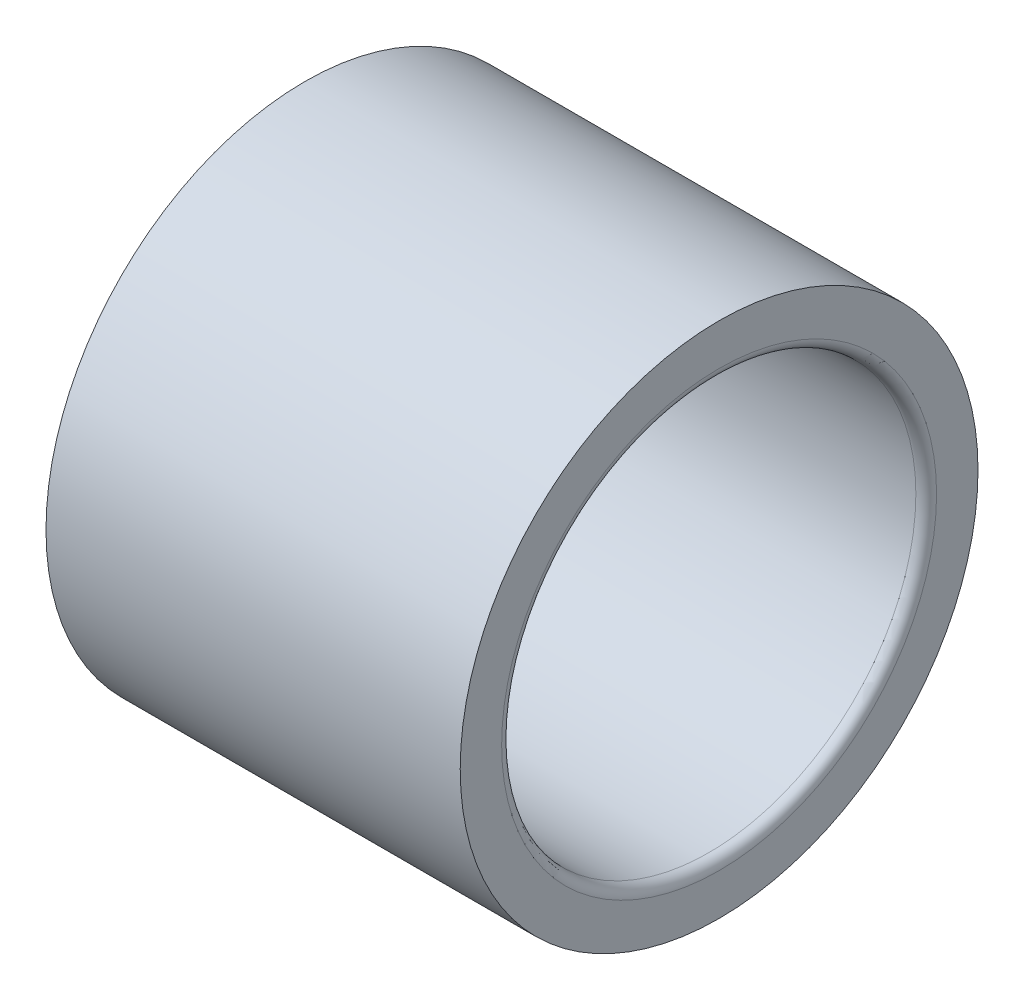
ISO-10303-21;
HEADER;
FILE_DESCRIPTION(('STEP AP214'),'2;1');
FILE_NAME('part.step','',(''),(''),'','','');
FILE_SCHEMA(('AUTOMOTIVE_DESIGN { 1 0 10303 214 1 1 1 1 }'));
ENDSEC;
DATA;
#1=APPLICATION_CONTEXT('core data for automotive mechanical design processes');
#2=APPLICATION_PROTOCOL_DEFINITION('international standard','automotive_design',2000,#1);
#3=PRODUCT_CONTEXT('',#1,'mechanical');
#4=PRODUCT('Part','Part','',(#3));
#5=PRODUCT_RELATED_PRODUCT_CATEGORY('part','',(#4));
#6=PRODUCT_DEFINITION_FORMATION('','',#4);
#7=PRODUCT_DEFINITION_CONTEXT('part definition',#1,'design');
#8=PRODUCT_DEFINITION('design','',#6,#7);
#9=PRODUCT_DEFINITION_SHAPE('','',#8);
#10=(LENGTH_UNIT() NAMED_UNIT(*) SI_UNIT(.MILLI.,.METRE.));
#11=(NAMED_UNIT(*) PLANE_ANGLE_UNIT() SI_UNIT($,.RADIAN.));
#12=(NAMED_UNIT(*) SI_UNIT($,.STERADIAN.) SOLID_ANGLE_UNIT());
#13=UNCERTAINTY_MEASURE_WITH_UNIT(LENGTH_MEASURE(1.E-05),#10,'distance_accuracy_value','');
#14=(GEOMETRIC_REPRESENTATION_CONTEXT(3) GLOBAL_UNCERTAINTY_ASSIGNED_CONTEXT((#13)) GLOBAL_UNIT_ASSIGNED_CONTEXT((#10,
#11,#12)) REPRESENTATION_CONTEXT('',''));
#15=CARTESIAN_POINT('',(0.,0.,0.));
#16=DIRECTION('',(0.,0.,1.));
#17=DIRECTION('',(1.,0.,0.));
#18=AXIS2_PLACEMENT_3D('',#15,#16,#17);
#19=CARTESIAN_POINT('',(239.,0.,0.));
#20=DIRECTION('',(1.,0.,0.));
#21=DIRECTION('',(0.,0.,-1.));
#22=AXIS2_PLACEMENT_3D('',#19,#20,#21);
#23=CYLINDRICAL_SURFACE('',#22,4.);
#24=CARTESIAN_POINT('',(235.2,0.,0.));
#25=DIRECTION('',(-1.,0.,0.));
#26=DIRECTION('',(0.,0.,1.));
#27=AXIS2_PLACEMENT_3D('',#24,#25,#26);
#28=CIRCLE('',#27,4.);
#29=CARTESIAN_POINT('',(235.2,0.,4.));
#30=VERTEX_POINT('',#29);
#31=EDGE_CURVE('E59',#30,#30,#28,.F.);
#32=ORIENTED_EDGE('',*,*,#31,.F.);
#33=EDGE_LOOP('',(#32));
#34=FACE_BOUND('',#33,.T.);
#35=CARTESIAN_POINT('',(242.8,0.,0.));
#36=DIRECTION('',(-1.,0.,0.));
#37=DIRECTION('',(0.,0.,1.));
#38=AXIS2_PLACEMENT_3D('',#35,#36,#37);
#39=CIRCLE('',#38,4.);
#40=CARTESIAN_POINT('',(242.8,0.,4.));
#41=VERTEX_POINT('',#40);
#42=EDGE_CURVE('E253',#41,#41,#39,.T.);
#43=ORIENTED_EDGE('',*,*,#42,.F.);
#44=EDGE_LOOP('',(#43));
#45=FACE_BOUND('',#44,.T.);
#46=ADVANCED_FACE('F16',(#34,#45),#23,.F.);
#47=CARTESIAN_POINT('',(242.8,0.,0.));
#48=DIRECTION('',(-1.,0.,0.));
#49=DIRECTION('',(0.,0.,1.));
#50=AXIS2_PLACEMENT_3D('',#47,#48,#49);
#51=TOROIDAL_SURFACE('',#50,4.2,0.200000000000001);
#52=ORIENTED_EDGE('',*,*,#42,.T.);
#53=EDGE_LOOP('',(#52));
#54=FACE_BOUND('',#53,.T.);
#55=CARTESIAN_POINT('',(243.,0.,0.));
#56=DIRECTION('',(1.,0.,0.));
#57=DIRECTION('',(0.,0.,-1.));
#58=AXIS2_PLACEMENT_3D('',#55,#56,#57);
#59=CIRCLE('',#58,4.2);
#60=CARTESIAN_POINT('',(243.,4.2,0.));
#61=VERTEX_POINT('',#60);
#62=CARTESIAN_POINT('',(243.,0.,-4.2));
#63=VERTEX_POINT('',#62);
#64=EDGE_CURVE('E51',#61,#63,#59,.F.);
#65=ORIENTED_EDGE('',*,*,#64,.F.);
#66=CARTESIAN_POINT('',(243.,0.,0.));
#67=DIRECTION('',(1.,0.,0.));
#68=DIRECTION('',(0.,1.,0.));
#69=AXIS2_PLACEMENT_3D('',#66,#67,#68);
#70=CIRCLE('',#69,4.2);
#71=CARTESIAN_POINT('',(243.,0.,4.2));
#72=VERTEX_POINT('',#71);
#73=EDGE_CURVE('E55',#72,#61,#70,.F.);
#74=ORIENTED_EDGE('',*,*,#73,.F.);
#75=CARTESIAN_POINT('',(243.,0.,0.));
#76=DIRECTION('',(1.,0.,0.));
#77=DIRECTION('',(0.,0.,1.));
#78=AXIS2_PLACEMENT_3D('',#75,#76,#77);
#79=CIRCLE('',#78,4.2);
#80=EDGE_CURVE('E49',#63,#72,#79,.F.);
#81=ORIENTED_EDGE('',*,*,#80,.F.);
#82=EDGE_LOOP('',(#65,#74,#81));
#83=FACE_BOUND('',#82,.T.);
#84=ADVANCED_FACE('F54',(#54,#83),#51,.T.);
#85=CARTESIAN_POINT('',(235.2,0.,0.));
#86=DIRECTION('',(-1.,0.,0.));
#87=DIRECTION('',(0.,0.,1.));
#88=AXIS2_PLACEMENT_3D('',#85,#86,#87);
#89=TOROIDAL_SURFACE('',#88,4.2,0.200000000000001);
#90=ORIENTED_EDGE('',*,*,#31,.T.);
#91=EDGE_LOOP('',(#90));
#92=FACE_BOUND('',#91,.T.);
#93=CARTESIAN_POINT('',(235.,0.,0.));
#94=DIRECTION('',(-1.,0.,0.));
#95=DIRECTION('',(0.,0.,-1.));
#96=AXIS2_PLACEMENT_3D('',#93,#94,#95);
#97=CIRCLE('',#96,4.2);
#98=CARTESIAN_POINT('',(235.,0.,4.2));
#99=VERTEX_POINT('',#98);
#100=CARTESIAN_POINT('',(235.,0.,-4.2));
#101=VERTEX_POINT('',#100);
#102=EDGE_CURVE('E35',#99,#101,#97,.F.);
#103=ORIENTED_EDGE('',*,*,#102,.F.);
#104=CARTESIAN_POINT('',(235.,0.,0.));
#105=DIRECTION('',(-1.,0.,0.));
#106=DIRECTION('',(0.,0.,1.));
#107=AXIS2_PLACEMENT_3D('',#104,#105,#106);
#108=CIRCLE('',#107,4.2);
#109=CARTESIAN_POINT('',(235.,4.2,0.));
#110=VERTEX_POINT('',#109);
#111=EDGE_CURVE('E121',#110,#99,#108,.F.);
#112=ORIENTED_EDGE('',*,*,#111,.F.);
#113=CARTESIAN_POINT('',(235.,0.,0.));
#114=DIRECTION('',(-1.,0.,0.));
#115=DIRECTION('',(0.,1.,0.));
#116=AXIS2_PLACEMENT_3D('',#113,#114,#115);
#117=CIRCLE('',#116,4.2);
#118=EDGE_CURVE('E66',#101,#110,#117,.F.);
#119=ORIENTED_EDGE('',*,*,#118,.F.);
#120=EDGE_LOOP('',(#103,#112,#119));
#121=FACE_BOUND('',#120,.T.);
#122=ADVANCED_FACE('F86',(#92,#121),#89,.T.);
#123=CARTESIAN_POINT('',(243.,4.6,0.));
#124=DIRECTION('',(1.,0.,0.));
#125=DIRECTION('',(0.,1.,0.));
#126=AXIS2_PLACEMENT_3D('',#123,#124,#125);
#127=PLANE('',#126);
#128=ORIENTED_EDGE('',*,*,#80,.T.);
#129=ORIENTED_EDGE('',*,*,#73,.T.);
#130=ORIENTED_EDGE('',*,*,#64,.T.);
#131=EDGE_LOOP('',(#128,#129,#130));
#132=FACE_BOUND('',#131,.T.);
#133=CARTESIAN_POINT('',(243.,0.,0.));
#134=DIRECTION('',(1.,0.,0.));
#135=DIRECTION('',(0.,0.,-1.));
#136=AXIS2_PLACEMENT_3D('',#133,#134,#135);
#137=CIRCLE('',#136,5.);
#138=CARTESIAN_POINT('',(243.,0.,-5.));
#139=VERTEX_POINT('',#138);
#140=EDGE_CURVE('E26',#139,#139,#137,.F.);
#141=ORIENTED_EDGE('',*,*,#140,.F.);
#142=EDGE_LOOP('',(#141));
#143=FACE_BOUND('',#142,.T.);
#144=ADVANCED_FACE('F63',(#132,#143),#127,.T.);
#145=CARTESIAN_POINT('',(235.,4.6,0.));
#146=DIRECTION('',(-1.,0.,0.));
#147=DIRECTION('',(0.,0.,1.));
#148=AXIS2_PLACEMENT_3D('',#145,#146,#147);
#149=PLANE('',#148);
#150=CARTESIAN_POINT('',(235.,0.,0.));
#151=DIRECTION('',(1.,0.,0.));
#152=DIRECTION('',(0.,0.,-1.));
#153=AXIS2_PLACEMENT_3D('',#150,#151,#152);
#154=CIRCLE('',#153,5.);
#155=CARTESIAN_POINT('',(235.,0.,-5.));
#156=VERTEX_POINT('',#155);
#157=EDGE_CURVE('E10',#156,#156,#154,.T.);
#158=ORIENTED_EDGE('',*,*,#157,.F.);
#159=EDGE_LOOP('',(#158));
#160=FACE_BOUND('',#159,.T.);
#161=ORIENTED_EDGE('',*,*,#111,.T.);
#162=ORIENTED_EDGE('',*,*,#102,.T.);
#163=ORIENTED_EDGE('',*,*,#118,.T.);
#164=EDGE_LOOP('',(#161,#162,#163));
#165=FACE_BOUND('',#164,.T.);
#166=ADVANCED_FACE('F85',(#160,#165),#149,.T.);
#167=CARTESIAN_POINT('',(239.,0.,0.));
#168=DIRECTION('',(1.,0.,0.));
#169=DIRECTION('',(0.,0.,-1.));
#170=AXIS2_PLACEMENT_3D('',#167,#168,#169);
#171=CYLINDRICAL_SURFACE('',#170,5.);
#172=ORIENTED_EDGE('',*,*,#140,.T.);
#173=EDGE_LOOP('',(#172));
#174=FACE_BOUND('',#173,.T.);
#175=ORIENTED_EDGE('',*,*,#157,.T.);
#176=EDGE_LOOP('',(#175));
#177=FACE_BOUND('',#176,.T.);
#178=ADVANCED_FACE('F161',(#174,#177),#171,.T.);
#179=CLOSED_SHELL('',(#46,#84,#122,#144,#166,#178));
#180=MANIFOLD_SOLID_BREP('B1',#179);
#181=ADVANCED_BREP_SHAPE_REPRESENTATION('',(#18,#180),#14);
#182=SHAPE_DEFINITION_REPRESENTATION(#9,#181);
ENDSEC;
END-ISO-10303-21;
